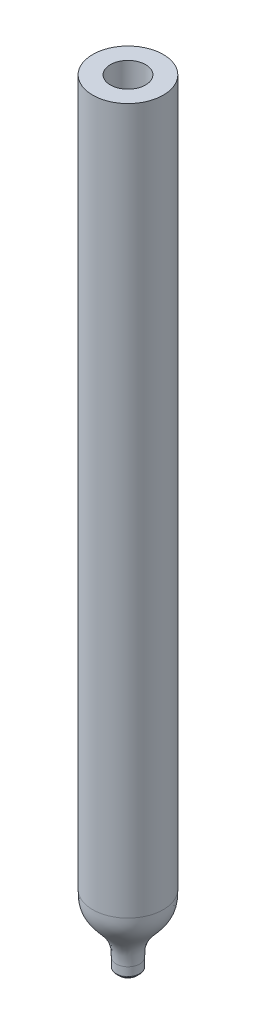
ISO-10303-21;
HEADER;
FILE_DESCRIPTION(('STEP AP214'),'2;1');
FILE_NAME('part.step','',(''),(''),'','','');
FILE_SCHEMA(('AUTOMOTIVE_DESIGN { 1 0 10303 214 1 1 1 1 }'));
ENDSEC;
DATA;
#1=APPLICATION_CONTEXT('core data for automotive mechanical design processes');
#2=APPLICATION_PROTOCOL_DEFINITION('international standard','automotive_design',2000,#1);
#3=PRODUCT_CONTEXT('',#1,'mechanical');
#4=PRODUCT('Part','Part','',(#3));
#5=PRODUCT_RELATED_PRODUCT_CATEGORY('part','',(#4));
#6=PRODUCT_DEFINITION_FORMATION('','',#4);
#7=PRODUCT_DEFINITION_CONTEXT('part definition',#1,'design');
#8=PRODUCT_DEFINITION('design','',#6,#7);
#9=PRODUCT_DEFINITION_SHAPE('','',#8);
#10=(LENGTH_UNIT() NAMED_UNIT(*) SI_UNIT(.MILLI.,.METRE.));
#11=(NAMED_UNIT(*) PLANE_ANGLE_UNIT() SI_UNIT($,.RADIAN.));
#12=(NAMED_UNIT(*) SI_UNIT($,.STERADIAN.) SOLID_ANGLE_UNIT());
#13=UNCERTAINTY_MEASURE_WITH_UNIT(LENGTH_MEASURE(1.E-05),#10,'distance_accuracy_value','');
#14=(GEOMETRIC_REPRESENTATION_CONTEXT(3) GLOBAL_UNCERTAINTY_ASSIGNED_CONTEXT((#13)) GLOBAL_UNIT_ASSIGNED_CONTEXT((#10,
#11,#12)) REPRESENTATION_CONTEXT('',''));
#15=CARTESIAN_POINT('',(0.,0.,0.));
#16=DIRECTION('',(0.,0.,1.));
#17=DIRECTION('',(1.,0.,0.));
#18=AXIS2_PLACEMENT_3D('',#15,#16,#17);
#19=CARTESIAN_POINT('',(0.,0.,0.));
#20=DIRECTION('',(0.,1.,0.));
#21=DIRECTION('',(0.,0.,1.));
#22=AXIS2_PLACEMENT_3D('',#19,#20,#21);
#23=CYLINDRICAL_SURFACE('',#22,1.5);
#24=CARTESIAN_POINT('',(0.,0.,0.));
#25=DIRECTION('',(0.,1.,0.));
#26=DIRECTION('',(0.,0.,1.));
#27=AXIS2_PLACEMENT_3D('',#24,#25,#26);
#28=CIRCLE('',#27,1.5);
#29=CARTESIAN_POINT('',(0.,0.,1.5));
#30=VERTEX_POINT('',#29);
#31=EDGE_CURVE('E44',#30,#30,#28,.T.);
#32=ORIENTED_EDGE('',*,*,#31,.F.);
#33=EDGE_LOOP('',(#32));
#34=FACE_BOUND('',#33,.T.);
#35=CARTESIAN_POINT('',(0.,61.,0.));
#36=DIRECTION('',(0.,1.,0.));
#37=DIRECTION('',(0.,0.,1.));
#38=AXIS2_PLACEMENT_3D('',#35,#36,#37);
#39=CIRCLE('',#38,1.49999999999999);
#40=CARTESIAN_POINT('',(0.,61.,1.49999999999999));
#41=VERTEX_POINT('',#40);
#42=EDGE_CURVE('E64',#41,#41,#39,.T.);
#43=ORIENTED_EDGE('',*,*,#42,.T.);
#44=EDGE_LOOP('',(#43));
#45=FACE_BOUND('',#44,.T.);
#46=ADVANCED_FACE('F29',(#34,#45),#23,.F.);
#47=CARTESIAN_POINT('',(1.5,0.,0.));
#48=CARTESIAN_POINT('',(1.5,-0.0819832418988206,0.));
#49=CARTESIAN_POINT('',(1.40715789473684,-1.56154174680993,0.));
#50=CARTESIAN_POINT('',(0.348,-1.5690295749582,0.));
#51=CARTESIAN_POINT('',(0.25,-3.87432831560301,0.));
#52=CARTESIAN_POINT('',(0.25,-4.,0.));
#53=B_SPLINE_CURVE_WITH_KNOTS('',3,(#47,#48,#49,#50,#51,#52),.UNSPECIFIED.,.F.,.F.,(4,1,1,4),
(0.,0.05,0.95,1.),.UNSPECIFIED.);
#54=CARTESIAN_POINT('',(0.,0.,0.));
#55=DIRECTION('',(0.,1.,0.));
#56=AXIS1_PLACEMENT('',#54,#55);
#57=SURFACE_OF_REVOLUTION('',#53,#56);
#58=CARTESIAN_POINT('',(0.,-4.,0.));
#59=DIRECTION('',(0.,1.,0.));
#60=DIRECTION('',(0.,0.,1.));
#61=AXIS2_PLACEMENT_3D('',#58,#59,#60);
#62=CIRCLE('',#61,0.25);
#63=CARTESIAN_POINT('',(0.,-4.,0.25));
#64=VERTEX_POINT('',#63);
#65=EDGE_CURVE('E49',#64,#64,#62,.T.);
#66=ORIENTED_EDGE('',*,*,#65,.F.);
#67=EDGE_LOOP('',(#66));
#68=FACE_BOUND('',#67,.T.);
#69=ORIENTED_EDGE('',*,*,#31,.T.);
#70=EDGE_LOOP('',(#69));
#71=FACE_BOUND('',#70,.T.);
#72=ADVANCED_FACE('F95',(#68,#71),#57,.T.);
#73=CARTESIAN_POINT('',(0.,0.,0.));
#74=DIRECTION('',(0.,1.,0.));
#75=DIRECTION('',(0.,0.,1.));
#76=AXIS2_PLACEMENT_3D('',#73,#74,#75);
#77=CYLINDRICAL_SURFACE('',#76,0.25);
#78=CARTESIAN_POINT('',(0.,-5.,0.));
#79=DIRECTION('',(0.,1.,0.));
#80=DIRECTION('',(0.,0.,1.));
#81=AXIS2_PLACEMENT_3D('',#78,#79,#80);
#82=CIRCLE('',#81,0.250000000000001);
#83=CARTESIAN_POINT('',(0.,-5.,0.250000000000001));
#84=VERTEX_POINT('',#83);
#85=EDGE_CURVE('E52',#84,#84,#82,.T.);
#86=ORIENTED_EDGE('',*,*,#85,.F.);
#87=EDGE_LOOP('',(#86));
#88=FACE_BOUND('',#87,.T.);
#89=ORIENTED_EDGE('',*,*,#65,.T.);
#90=EDGE_LOOP('',(#89));
#91=FACE_BOUND('',#90,.T.);
#92=ADVANCED_FACE('F91',(#88,#91),#77,.F.);
#93=CARTESIAN_POINT('',(0.250000000000001,-5.,0.));
#94=DIRECTION('',(0.,1.,0.));
#95=DIRECTION('',(0.,0.,1.));
#96=AXIS2_PLACEMENT_3D('',#93,#94,#95);
#97=PLANE('',#96);
#98=CARTESIAN_POINT('',(0.,-5.,0.));
#99=DIRECTION('',(0.,1.,0.));
#100=DIRECTION('',(0.,0.,1.));
#101=AXIS2_PLACEMENT_3D('',#98,#99,#100);
#102=CIRCLE('',#101,0.750000000000008);
#103=CARTESIAN_POINT('',(0.,-5.,0.750000000000008));
#104=VERTEX_POINT('',#103);
#105=EDGE_CURVE('E40',#104,#104,#102,.F.);
#106=ORIENTED_EDGE('',*,*,#105,.T.);
#107=EDGE_LOOP('',(#106));
#108=FACE_BOUND('',#107,.T.);
#109=ORIENTED_EDGE('',*,*,#85,.T.);
#110=EDGE_LOOP('',(#109));
#111=FACE_BOUND('',#110,.T.);
#112=ADVANCED_FACE('F88',(#108,#111),#97,.F.);
#113=CARTESIAN_POINT('',(0.,0.,0.));
#114=DIRECTION('',(0.,1.,0.));
#115=DIRECTION('',(0.,0.,1.));
#116=AXIS2_PLACEMENT_3D('',#113,#114,#115);
#117=CYLINDRICAL_SURFACE('',#116,1.);
#118=CARTESIAN_POINT('',(0.,-4.7085786437627,0.));
#119=DIRECTION('',(0.,-1.,0.));
#120=DIRECTION('',(0.,0.,-1.));
#121=AXIS2_PLACEMENT_3D('',#118,#119,#120);
#122=CIRCLE('',#121,1.);
#123=CARTESIAN_POINT('',(0.,-4.7085786437627,-1.));
#124=VERTEX_POINT('',#123);
#125=EDGE_CURVE('E36',#124,#124,#122,.F.);
#126=ORIENTED_EDGE('',*,*,#125,.T.);
#127=EDGE_LOOP('',(#126));
#128=FACE_BOUND('',#127,.T.);
#129=CARTESIAN_POINT('',(0.,-4.,0.));
#130=DIRECTION('',(0.,1.,0.));
#131=DIRECTION('',(0.,0.,1.));
#132=AXIS2_PLACEMENT_3D('',#129,#130,#131);
#133=CIRCLE('',#132,1.);
#134=CARTESIAN_POINT('',(0.,-4.,1.));
#135=VERTEX_POINT('',#134);
#136=EDGE_CURVE('E55',#135,#135,#133,.T.);
#137=ORIENTED_EDGE('',*,*,#136,.F.);
#138=EDGE_LOOP('',(#137));
#139=FACE_BOUND('',#138,.T.);
#140=ADVANCED_FACE('F83',(#128,#139),#117,.T.);
#141=CARTESIAN_POINT('',(1.,-4.,0.));
#142=CARTESIAN_POINT('',(1.,-2.85232622359341,0.));
#143=CARTESIAN_POINT('',(1.,-1.70465244718682,0.));
#144=CARTESIAN_POINT('',(2.99999999999999,-1.29534755281312,0.));
#145=CARTESIAN_POINT('',(3.,-0.147673776406589,0.));
#146=CARTESIAN_POINT('',(3.,1.,0.));
#147=B_SPLINE_CURVE_WITH_KNOTS('',5,(#141,#142,#143,#144,#145,#146),.UNSPECIFIED.,.F.,.F.,(6,6),
(0.,1.),.UNSPECIFIED.);
#148=CARTESIAN_POINT('',(0.,0.,0.));
#149=DIRECTION('',(0.,1.,0.));
#150=AXIS1_PLACEMENT('',#148,#149);
#151=SURFACE_OF_REVOLUTION('',#147,#150);
#152=CARTESIAN_POINT('',(0.,1.,0.));
#153=DIRECTION('',(0.,1.,0.));
#154=DIRECTION('',(0.,0.,1.));
#155=AXIS2_PLACEMENT_3D('',#152,#153,#154);
#156=CIRCLE('',#155,3.);
#157=CARTESIAN_POINT('',(0.,1.,3.));
#158=VERTEX_POINT('',#157);
#159=EDGE_CURVE('E58',#158,#158,#156,.T.);
#160=ORIENTED_EDGE('',*,*,#159,.F.);
#161=EDGE_LOOP('',(#160));
#162=FACE_BOUND('',#161,.T.);
#163=ORIENTED_EDGE('',*,*,#136,.T.);
#164=EDGE_LOOP('',(#163));
#165=FACE_BOUND('',#164,.T.);
#166=ADVANCED_FACE('F78',(#162,#165),#151,.T.);
#167=CARTESIAN_POINT('',(0.,0.,0.));
#168=DIRECTION('',(0.,1.,0.));
#169=DIRECTION('',(0.,0.,1.));
#170=AXIS2_PLACEMENT_3D('',#167,#168,#169);
#171=CYLINDRICAL_SURFACE('',#170,3.);
#172=CARTESIAN_POINT('',(0.,61.,0.));
#173=DIRECTION('',(0.,1.,0.));
#174=DIRECTION('',(0.,0.,1.));
#175=AXIS2_PLACEMENT_3D('',#172,#173,#174);
#176=CIRCLE('',#175,2.99999999999999);
#177=CARTESIAN_POINT('',(0.,61.,2.99999999999999));
#178=VERTEX_POINT('',#177);
#179=EDGE_CURVE('E61',#178,#178,#176,.T.);
#180=ORIENTED_EDGE('',*,*,#179,.F.);
#181=EDGE_LOOP('',(#180));
#182=FACE_BOUND('',#181,.T.);
#183=ORIENTED_EDGE('',*,*,#159,.T.);
#184=EDGE_LOOP('',(#183));
#185=FACE_BOUND('',#184,.T.);
#186=ADVANCED_FACE('F82',(#182,#185),#171,.T.);
#187=CARTESIAN_POINT('',(1.49999999999999,61.,0.));
#188=DIRECTION('',(0.,-1.,0.));
#189=DIRECTION('',(0.,0.,-1.));
#190=AXIS2_PLACEMENT_3D('',#187,#188,#189);
#191=PLANE('',#190);
#192=ORIENTED_EDGE('',*,*,#42,.F.);
#193=EDGE_LOOP('',(#192));
#194=FACE_BOUND('',#193,.T.);
#195=ORIENTED_EDGE('',*,*,#179,.T.);
#196=EDGE_LOOP('',(#195));
#197=FACE_BOUND('',#196,.T.);
#198=ADVANCED_FACE('F104',(#194,#197),#191,.F.);
#199=CARTESIAN_POINT('',(0.,-4.75000000000001,0.));
#200=DIRECTION('',(0.,1.,0.));
#201=DIRECTION('',(0.,0.,1.));
#202=AXIS2_PLACEMENT_3D('',#199,#200,#201);
#203=CONICAL_SURFACE('',#202,1.,0.785398163397454);
#204=CARTESIAN_POINT('',(0.,-4.77928932188136,0.));
#205=DIRECTION('',(0.,1.,0.));
#206=DIRECTION('',(0.,0.,1.));
#207=AXIS2_PLACEMENT_3D('',#204,#205,#206);
#208=CIRCLE('',#207,0.970710678118655);
#209=CARTESIAN_POINT('',(0.,-4.77928932188136,0.970710678118655));
#210=VERTEX_POINT('',#209);
#211=EDGE_CURVE('E10',#210,#210,#208,.F.);
#212=ORIENTED_EDGE('',*,*,#211,.T.);
#213=EDGE_LOOP('',(#212));
#214=FACE_BOUND('',#213,.T.);
#215=ORIENTED_EDGE('',*,*,#105,.F.);
#216=EDGE_LOOP('',(#215));
#217=FACE_BOUND('',#216,.T.);
#218=ADVANCED_FACE('F102',(#214,#217),#203,.T.);
#219=CARTESIAN_POINT('',(0.,-4.7085786437627,0.));
#220=DIRECTION('',(0.,-1.,0.));
#221=DIRECTION('',(0.,0.,-1.));
#222=AXIS2_PLACEMENT_3D('',#219,#220,#221);
#223=TOROIDAL_SURFACE('',#222,0.9,0.1);
#224=ORIENTED_EDGE('',*,*,#211,.F.);
#225=EDGE_LOOP('',(#224));
#226=FACE_BOUND('',#225,.T.);
#227=ORIENTED_EDGE('',*,*,#125,.F.);
#228=EDGE_LOOP('',(#227));
#229=FACE_BOUND('',#228,.T.);
#230=ADVANCED_FACE('F31',(#226,#229),#223,.T.);
#231=CLOSED_SHELL('',(#46,#72,#92,#112,#140,#166,#186,#198,#218,#230));
#232=MANIFOLD_SOLID_BREP('B2',#231);
#233=ADVANCED_BREP_SHAPE_REPRESENTATION('',(#18,#232),#14);
#234=SHAPE_DEFINITION_REPRESENTATION(#9,#233);
ENDSEC;
END-ISO-10303-21;
